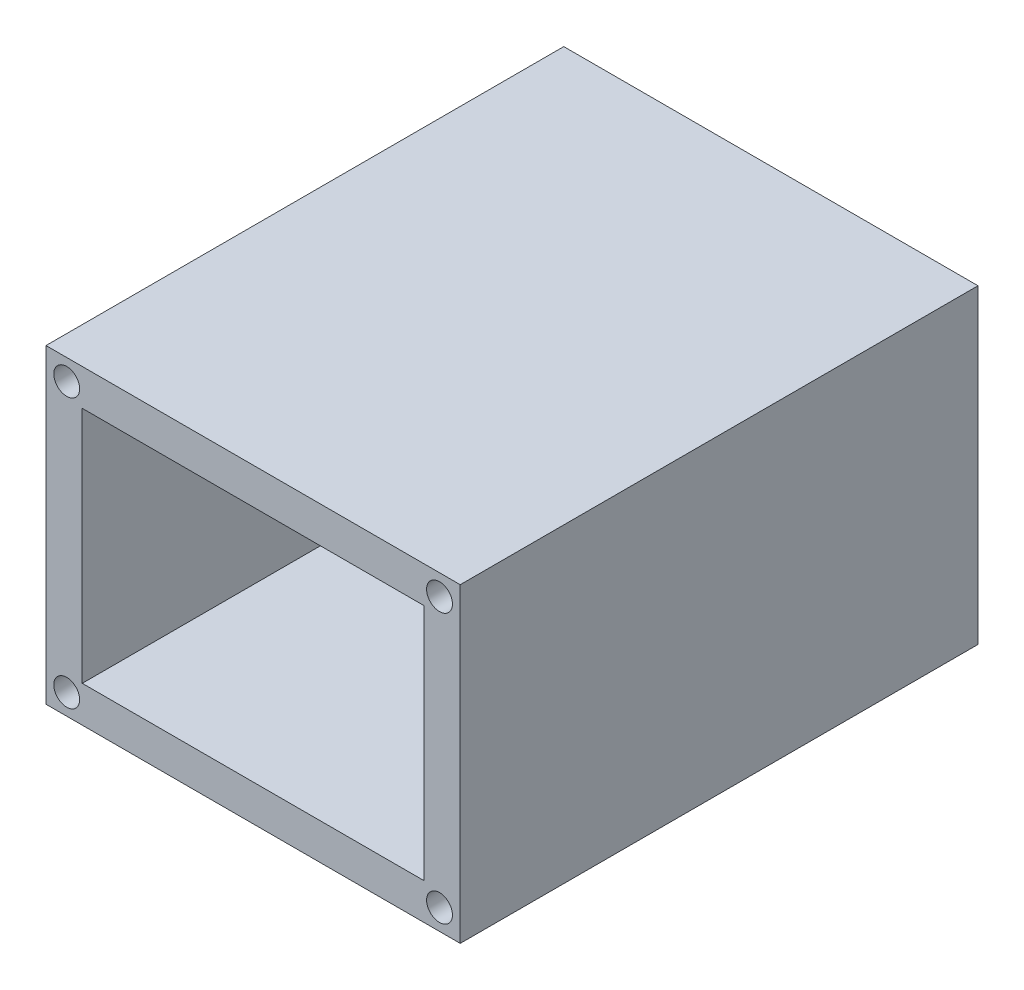
ISO-10303-21;
HEADER;
FILE_DESCRIPTION(('STEP AP214'),'2;1');
FILE_NAME('part.step','',(''),(''),'','','');
FILE_SCHEMA(('AUTOMOTIVE_DESIGN { 1 0 10303 214 1 1 1 1 }'));
ENDSEC;
DATA;
#1=APPLICATION_CONTEXT('core data for automotive mechanical design processes');
#2=APPLICATION_PROTOCOL_DEFINITION('international standard','automotive_design',2000,#1);
#3=PRODUCT_CONTEXT('',#1,'mechanical');
#4=PRODUCT('Part','Part','',(#3));
#5=PRODUCT_RELATED_PRODUCT_CATEGORY('part','',(#4));
#6=PRODUCT_DEFINITION_FORMATION('','',#4);
#7=PRODUCT_DEFINITION_CONTEXT('part definition',#1,'design');
#8=PRODUCT_DEFINITION('design','',#6,#7);
#9=PRODUCT_DEFINITION_SHAPE('','',#8);
#10=(LENGTH_UNIT() NAMED_UNIT(*) SI_UNIT(.MILLI.,.METRE.));
#11=(NAMED_UNIT(*) PLANE_ANGLE_UNIT() SI_UNIT($,.RADIAN.));
#12=(NAMED_UNIT(*) SI_UNIT($,.STERADIAN.) SOLID_ANGLE_UNIT());
#13=UNCERTAINTY_MEASURE_WITH_UNIT(LENGTH_MEASURE(1.E-05),#10,'distance_accuracy_value','');
#14=(GEOMETRIC_REPRESENTATION_CONTEXT(3) GLOBAL_UNCERTAINTY_ASSIGNED_CONTEXT((#13)) GLOBAL_UNIT_ASSIGNED_CONTEXT((#10,
#11,#12)) REPRESENTATION_CONTEXT('',''));
#15=CARTESIAN_POINT('',(0.,0.,0.));
#16=DIRECTION('',(0.,0.,1.));
#17=DIRECTION('',(1.,0.,0.));
#18=AXIS2_PLACEMENT_3D('',#15,#16,#17);
#19=CARTESIAN_POINT('',(0.,0.,50.));
#20=DIRECTION('',(1.,0.,0.));
#21=DIRECTION('',(0.,0.,-1.));
#22=AXIS2_PLACEMENT_3D('',#19,#20,#21);
#23=PLANE('',#22);
#24=DIRECTION('',(0.,-1.,0.));
#25=VECTOR('',#24,1.);
#26=CARTESIAN_POINT('',(0.,0.,0.));
#27=LINE('',#26,#25);
#28=CARTESIAN_POINT('',(0.,30.,0.));
#29=VERTEX_POINT('',#28);
#30=CARTESIAN_POINT('',(0.,0.,0.));
#31=VERTEX_POINT('',#30);
#32=EDGE_CURVE('E134',#29,#31,#27,.T.);
#33=ORIENTED_EDGE('',*,*,#32,.T.);
#34=DIRECTION('',(0.,0.,-1.));
#35=VECTOR('',#34,1.);
#36=CARTESIAN_POINT('',(0.,0.,50.));
#37=LINE('',#36,#35);
#38=CARTESIAN_POINT('',(0.,0.,50.));
#39=VERTEX_POINT('',#38);
#40=EDGE_CURVE('E11',#39,#31,#37,.T.);
#41=ORIENTED_EDGE('',*,*,#40,.F.);
#42=DIRECTION('',(0.,-1.,0.));
#43=VECTOR('',#42,1.);
#44=CARTESIAN_POINT('',(0.,0.,50.));
#45=LINE('',#44,#43);
#46=CARTESIAN_POINT('',(0.,30.,50.));
#47=VERTEX_POINT('',#46);
#48=EDGE_CURVE('E138',#47,#39,#45,.T.);
#49=ORIENTED_EDGE('',*,*,#48,.F.);
#50=DIRECTION('',(0.,0.,-1.));
#51=VECTOR('',#50,1.);
#52=CARTESIAN_POINT('',(0.,30.,50.));
#53=LINE('',#52,#51);
#54=EDGE_CURVE('E148',#47,#29,#53,.T.);
#55=ORIENTED_EDGE('',*,*,#54,.T.);
#56=EDGE_LOOP('',(#33,#41,#49,#55));
#57=FACE_BOUND('',#56,.T.);
#58=ADVANCED_FACE('F33',(#57),#23,.F.);
#59=CARTESIAN_POINT('',(0.,0.,50.));
#60=DIRECTION('',(0.,1.,0.));
#61=DIRECTION('',(0.,0.,1.));
#62=AXIS2_PLACEMENT_3D('',#59,#60,#61);
#63=PLANE('',#62);
#64=DIRECTION('',(1.,0.,0.));
#65=VECTOR('',#64,1.);
#66=CARTESIAN_POINT('',(0.,0.,0.));
#67=LINE('',#66,#65);
#68=CARTESIAN_POINT('',(40.,0.,0.));
#69=VERTEX_POINT('',#68);
#70=EDGE_CURVE('E151',#31,#69,#67,.T.);
#71=ORIENTED_EDGE('',*,*,#70,.T.);
#72=DIRECTION('',(0.,0.,-1.));
#73=VECTOR('',#72,1.);
#74=CARTESIAN_POINT('',(40.,0.,50.));
#75=LINE('',#74,#73);
#76=CARTESIAN_POINT('',(40.,0.,50.));
#77=VERTEX_POINT('',#76);
#78=EDGE_CURVE('E40',#77,#69,#75,.T.);
#79=ORIENTED_EDGE('',*,*,#78,.F.);
#80=DIRECTION('',(1.,0.,0.));
#81=VECTOR('',#80,1.);
#82=CARTESIAN_POINT('',(0.,0.,50.));
#83=LINE('',#82,#81);
#84=EDGE_CURVE('E141',#39,#77,#83,.T.);
#85=ORIENTED_EDGE('',*,*,#84,.F.);
#86=ORIENTED_EDGE('',*,*,#40,.T.);
#87=EDGE_LOOP('',(#71,#79,#85,#86));
#88=FACE_BOUND('',#87,.T.);
#89=ADVANCED_FACE('F179',(#88),#63,.F.);
#90=CARTESIAN_POINT('',(40.,0.,50.));
#91=DIRECTION('',(-1.,0.,0.));
#92=DIRECTION('',(0.,0.,1.));
#93=AXIS2_PLACEMENT_3D('',#90,#91,#92);
#94=PLANE('',#93);
#95=DIRECTION('',(0.,1.,0.));
#96=VECTOR('',#95,1.);
#97=CARTESIAN_POINT('',(40.,0.,0.));
#98=LINE('',#97,#96);
#99=CARTESIAN_POINT('',(40.,30.,0.));
#100=VERTEX_POINT('',#99);
#101=EDGE_CURVE('E153',#69,#100,#98,.T.);
#102=ORIENTED_EDGE('',*,*,#101,.T.);
#103=DIRECTION('',(0.,0.,-1.));
#104=VECTOR('',#103,1.);
#105=CARTESIAN_POINT('',(40.,30.,50.));
#106=LINE('',#105,#104);
#107=CARTESIAN_POINT('',(40.,30.,50.));
#108=VERTEX_POINT('',#107);
#109=EDGE_CURVE('E158',#108,#100,#106,.T.);
#110=ORIENTED_EDGE('',*,*,#109,.F.);
#111=DIRECTION('',(0.,1.,0.));
#112=VECTOR('',#111,1.);
#113=CARTESIAN_POINT('',(40.,0.,50.));
#114=LINE('',#113,#112);
#115=EDGE_CURVE('E144',#77,#108,#114,.T.);
#116=ORIENTED_EDGE('',*,*,#115,.F.);
#117=ORIENTED_EDGE('',*,*,#78,.T.);
#118=EDGE_LOOP('',(#102,#110,#116,#117));
#119=FACE_BOUND('',#118,.T.);
#120=ADVANCED_FACE('F165',(#119),#94,.F.);
#121=CARTESIAN_POINT('',(0.,30.,50.));
#122=DIRECTION('',(0.,-1.,0.));
#123=DIRECTION('',(0.,0.,-1.));
#124=AXIS2_PLACEMENT_3D('',#121,#122,#123);
#125=PLANE('',#124);
#126=DIRECTION('',(-1.,0.,0.));
#127=VECTOR('',#126,1.);
#128=CARTESIAN_POINT('',(0.,30.,0.));
#129=LINE('',#128,#127);
#130=EDGE_CURVE('E142',#100,#29,#129,.T.);
#131=ORIENTED_EDGE('',*,*,#130,.T.);
#132=ORIENTED_EDGE('',*,*,#54,.F.);
#133=DIRECTION('',(-1.,0.,0.));
#134=VECTOR('',#133,1.);
#135=CARTESIAN_POINT('',(0.,30.,50.));
#136=LINE('',#135,#134);
#137=EDGE_CURVE('E146',#108,#47,#136,.T.);
#138=ORIENTED_EDGE('',*,*,#137,.F.);
#139=ORIENTED_EDGE('',*,*,#109,.T.);
#140=EDGE_LOOP('',(#131,#132,#138,#139));
#141=FACE_BOUND('',#140,.T.);
#142=ADVANCED_FACE('F172',(#141),#125,.F.);
#143=CARTESIAN_POINT('',(0.,0.,50.));
#144=DIRECTION('',(0.,0.,-1.));
#145=DIRECTION('',(-1.,0.,0.));
#146=AXIS2_PLACEMENT_3D('',#143,#144,#145);
#147=PLANE('',#146);
#148=CARTESIAN_POINT('',(2.,28.,50.));
#149=DIRECTION('',(0.,0.,1.));
#150=DIRECTION('',(-1.,0.,0.));
#151=AXIS2_PLACEMENT_3D('',#148,#149,#150);
#152=CIRCLE('',#151,1.25);
#153=CARTESIAN_POINT('',(0.749999999999997,28.,50.));
#154=VERTEX_POINT('',#153);
#155=EDGE_CURVE('E241',#154,#154,#152,.T.);
#156=ORIENTED_EDGE('',*,*,#155,.F.);
#157=EDGE_LOOP('',(#156));
#158=FACE_BOUND('',#157,.T.);
#159=CARTESIAN_POINT('',(2.00000000000002,1.99999999999997,50.));
#160=DIRECTION('',(0.,0.,1.));
#161=DIRECTION('',(1.,0.,0.));
#162=AXIS2_PLACEMENT_3D('',#159,#160,#161);
#163=CIRCLE('',#162,1.25);
#164=CARTESIAN_POINT('',(3.25000000000002,1.99999999999997,50.));
#165=VERTEX_POINT('',#164);
#166=EDGE_CURVE('E250',#165,#165,#163,.T.);
#167=ORIENTED_EDGE('',*,*,#166,.F.);
#168=EDGE_LOOP('',(#167));
#169=FACE_BOUND('',#168,.T.);
#170=CARTESIAN_POINT('',(38.,2.,50.));
#171=DIRECTION('',(0.,0.,1.));
#172=DIRECTION('',(-1.,0.,0.));
#173=AXIS2_PLACEMENT_3D('',#170,#171,#172);
#174=CIRCLE('',#173,1.25);
#175=CARTESIAN_POINT('',(36.75,2.,50.));
#176=VERTEX_POINT('',#175);
#177=EDGE_CURVE('E256',#176,#176,#174,.T.);
#178=ORIENTED_EDGE('',*,*,#177,.F.);
#179=EDGE_LOOP('',(#178));
#180=FACE_BOUND('',#179,.T.);
#181=CARTESIAN_POINT('',(38.,28.,50.));
#182=DIRECTION('',(0.,0.,1.));
#183=DIRECTION('',(1.,0.,0.));
#184=AXIS2_PLACEMENT_3D('',#181,#182,#183);
#185=CIRCLE('',#184,1.25);
#186=CARTESIAN_POINT('',(39.25,28.,50.));
#187=VERTEX_POINT('',#186);
#188=EDGE_CURVE('E121',#187,#187,#185,.T.);
#189=ORIENTED_EDGE('',*,*,#188,.F.);
#190=EDGE_LOOP('',(#189));
#191=FACE_BOUND('',#190,.T.);
#192=DIRECTION('',(1.,0.,0.));
#193=VECTOR('',#192,1.);
#194=CARTESIAN_POINT('',(3.5,3.5,50.));
#195=LINE('',#194,#193);
#196=CARTESIAN_POINT('',(3.5,3.5,50.));
#197=VERTEX_POINT('',#196);
#198=CARTESIAN_POINT('',(36.5,3.5,50.));
#199=VERTEX_POINT('',#198);
#200=EDGE_CURVE('E127',#197,#199,#195,.T.);
#201=ORIENTED_EDGE('',*,*,#200,.F.);
#202=DIRECTION('',(0.,-1.,0.));
#203=VECTOR('',#202,1.);
#204=CARTESIAN_POINT('',(3.5,26.5,50.));
#205=LINE('',#204,#203);
#206=CARTESIAN_POINT('',(3.5,26.5,50.));
#207=VERTEX_POINT('',#206);
#208=EDGE_CURVE('E47',#207,#197,#205,.T.);
#209=ORIENTED_EDGE('',*,*,#208,.F.);
#210=DIRECTION('',(-1.,0.,0.));
#211=VECTOR('',#210,1.);
#212=CARTESIAN_POINT('',(3.5,26.5,50.));
#213=LINE('',#212,#211);
#214=CARTESIAN_POINT('',(36.5,26.5,50.));
#215=VERTEX_POINT('',#214);
#216=EDGE_CURVE('E115',#215,#207,#213,.T.);
#217=ORIENTED_EDGE('',*,*,#216,.F.);
#218=DIRECTION('',(0.,1.,0.));
#219=VECTOR('',#218,1.);
#220=CARTESIAN_POINT('',(36.5,26.5,50.));
#221=LINE('',#220,#219);
#222=EDGE_CURVE('E118',#199,#215,#221,.T.);
#223=ORIENTED_EDGE('',*,*,#222,.F.);
#224=EDGE_LOOP('',(#201,#209,#217,#223));
#225=FACE_BOUND('',#224,.T.);
#226=ORIENTED_EDGE('',*,*,#48,.T.);
#227=ORIENTED_EDGE('',*,*,#84,.T.);
#228=ORIENTED_EDGE('',*,*,#115,.T.);
#229=ORIENTED_EDGE('',*,*,#137,.T.);
#230=EDGE_LOOP('',(#226,#227,#228,#229));
#231=FACE_BOUND('',#230,.T.);
#232=ADVANCED_FACE('F178',(#158,#169,#180,#191,#225,#231),#147,.F.);
#233=CARTESIAN_POINT('',(0.,0.,0.));
#234=DIRECTION('',(0.,0.,-1.));
#235=DIRECTION('',(-1.,0.,0.));
#236=AXIS2_PLACEMENT_3D('',#233,#234,#235);
#237=PLANE('',#236);
#238=DIRECTION('',(0.,-1.,0.));
#239=VECTOR('',#238,1.);
#240=CARTESIAN_POINT('',(3.5,26.5,0.));
#241=LINE('',#240,#239);
#242=CARTESIAN_POINT('',(3.5,26.5,0.));
#243=VERTEX_POINT('',#242);
#244=CARTESIAN_POINT('',(3.5,3.5,0.));
#245=VERTEX_POINT('',#244);
#246=EDGE_CURVE('E99',#243,#245,#241,.T.);
#247=ORIENTED_EDGE('',*,*,#246,.T.);
#248=DIRECTION('',(1.,0.,0.));
#249=VECTOR('',#248,1.);
#250=CARTESIAN_POINT('',(3.5,3.5,0.));
#251=LINE('',#250,#249);
#252=CARTESIAN_POINT('',(36.5,3.5,0.));
#253=VERTEX_POINT('',#252);
#254=EDGE_CURVE('E108',#245,#253,#251,.T.);
#255=ORIENTED_EDGE('',*,*,#254,.T.);
#256=DIRECTION('',(0.,1.,0.));
#257=VECTOR('',#256,1.);
#258=CARTESIAN_POINT('',(36.5,26.5,0.));
#259=LINE('',#258,#257);
#260=CARTESIAN_POINT('',(36.5,26.5,0.));
#261=VERTEX_POINT('',#260);
#262=EDGE_CURVE('E55',#253,#261,#259,.T.);
#263=ORIENTED_EDGE('',*,*,#262,.T.);
#264=DIRECTION('',(-1.,0.,0.));
#265=VECTOR('',#264,1.);
#266=CARTESIAN_POINT('',(3.5,26.5,0.));
#267=LINE('',#266,#265);
#268=EDGE_CURVE('E105',#261,#243,#267,.T.);
#269=ORIENTED_EDGE('',*,*,#268,.T.);
#270=EDGE_LOOP('',(#247,#255,#263,#269));
#271=FACE_BOUND('',#270,.T.);
#272=ORIENTED_EDGE('',*,*,#32,.F.);
#273=ORIENTED_EDGE('',*,*,#130,.F.);
#274=ORIENTED_EDGE('',*,*,#101,.F.);
#275=ORIENTED_EDGE('',*,*,#70,.F.);
#276=EDGE_LOOP('',(#272,#273,#274,#275));
#277=FACE_BOUND('',#276,.T.);
#278=ADVANCED_FACE('F112',(#271,#277),#237,.T.);
#279=CARTESIAN_POINT('',(3.5,26.5,0.));
#280=DIRECTION('',(-1.,0.,0.));
#281=DIRECTION('',(0.,-1.,0.));
#282=AXIS2_PLACEMENT_3D('',#279,#280,#281);
#283=PLANE('',#282);
#284=ORIENTED_EDGE('',*,*,#208,.T.);
#285=DIRECTION('',(0.,0.,1.));
#286=VECTOR('',#285,1.);
#287=CARTESIAN_POINT('',(3.5,3.5,0.));
#288=LINE('',#287,#286);
#289=EDGE_CURVE('E95',#245,#197,#288,.T.);
#290=ORIENTED_EDGE('',*,*,#289,.F.);
#291=ORIENTED_EDGE('',*,*,#246,.F.);
#292=DIRECTION('',(0.,0.,1.));
#293=VECTOR('',#292,1.);
#294=CARTESIAN_POINT('',(3.5,26.5,0.));
#295=LINE('',#294,#293);
#296=EDGE_CURVE('E132',#243,#207,#295,.T.);
#297=ORIENTED_EDGE('',*,*,#296,.T.);
#298=EDGE_LOOP('',(#284,#290,#291,#297));
#299=FACE_BOUND('',#298,.T.);
#300=ADVANCED_FACE('F97',(#299),#283,.F.);
#301=CARTESIAN_POINT('',(3.5,26.5,0.));
#302=DIRECTION('',(0.,1.,0.));
#303=DIRECTION('',(-1.,0.,0.));
#304=AXIS2_PLACEMENT_3D('',#301,#302,#303);
#305=PLANE('',#304);
#306=ORIENTED_EDGE('',*,*,#216,.T.);
#307=ORIENTED_EDGE('',*,*,#296,.F.);
#308=ORIENTED_EDGE('',*,*,#268,.F.);
#309=DIRECTION('',(0.,0.,1.));
#310=VECTOR('',#309,1.);
#311=CARTESIAN_POINT('',(36.5,26.5,0.));
#312=LINE('',#311,#310);
#313=EDGE_CURVE('E135',#261,#215,#312,.T.);
#314=ORIENTED_EDGE('',*,*,#313,.T.);
#315=EDGE_LOOP('',(#306,#307,#308,#314));
#316=FACE_BOUND('',#315,.T.);
#317=ADVANCED_FACE('F196',(#316),#305,.F.);
#318=CARTESIAN_POINT('',(36.5,26.5,0.));
#319=DIRECTION('',(1.,0.,0.));
#320=DIRECTION('',(0.,1.,0.));
#321=AXIS2_PLACEMENT_3D('',#318,#319,#320);
#322=PLANE('',#321);
#323=ORIENTED_EDGE('',*,*,#222,.T.);
#324=ORIENTED_EDGE('',*,*,#313,.F.);
#325=ORIENTED_EDGE('',*,*,#262,.F.);
#326=DIRECTION('',(0.,0.,1.));
#327=VECTOR('',#326,1.);
#328=CARTESIAN_POINT('',(36.5,3.5,0.));
#329=LINE('',#328,#327);
#330=EDGE_CURVE('E104',#253,#199,#329,.T.);
#331=ORIENTED_EDGE('',*,*,#330,.T.);
#332=EDGE_LOOP('',(#323,#324,#325,#331));
#333=FACE_BOUND('',#332,.T.);
#334=ADVANCED_FACE('F200',(#333),#322,.F.);
#335=CARTESIAN_POINT('',(3.5,3.5,0.));
#336=DIRECTION('',(0.,-1.,0.));
#337=DIRECTION('',(1.,0.,0.));
#338=AXIS2_PLACEMENT_3D('',#335,#336,#337);
#339=PLANE('',#338);
#340=ORIENTED_EDGE('',*,*,#200,.T.);
#341=ORIENTED_EDGE('',*,*,#330,.F.);
#342=ORIENTED_EDGE('',*,*,#254,.F.);
#343=ORIENTED_EDGE('',*,*,#289,.T.);
#344=EDGE_LOOP('',(#340,#341,#342,#343));
#345=FACE_BOUND('',#344,.T.);
#346=ADVANCED_FACE('F109',(#345),#339,.F.);
#347=CARTESIAN_POINT('',(38.,28.,40.));
#348=DIRECTION('',(0.,0.,1.));
#349=DIRECTION('',(1.,0.,0.));
#350=AXIS2_PLACEMENT_3D('',#347,#348,#349);
#351=CYLINDRICAL_SURFACE('',#350,1.25);
#352=CARTESIAN_POINT('',(38.,28.,40.));
#353=DIRECTION('',(0.,0.,1.));
#354=DIRECTION('',(1.,0.,0.));
#355=AXIS2_PLACEMENT_3D('',#352,#353,#354);
#356=CIRCLE('',#355,1.25);
#357=CARTESIAN_POINT('',(39.25,28.,40.));
#358=VERTEX_POINT('',#357);
#359=EDGE_CURVE('E128',#358,#358,#356,.T.);
#360=ORIENTED_EDGE('',*,*,#359,.F.);
#361=EDGE_LOOP('',(#360));
#362=FACE_BOUND('',#361,.T.);
#363=ORIENTED_EDGE('',*,*,#188,.T.);
#364=EDGE_LOOP('',(#363));
#365=FACE_BOUND('',#364,.T.);
#366=ADVANCED_FACE('F199',(#362,#365),#351,.F.);
#367=CARTESIAN_POINT('',(38.,28.,40.));
#368=DIRECTION('',(0.,0.,1.));
#369=DIRECTION('',(1.,0.,0.));
#370=AXIS2_PLACEMENT_3D('',#367,#368,#369);
#371=PLANE('',#370);
#372=ORIENTED_EDGE('',*,*,#359,.T.);
#373=EDGE_LOOP('',(#372));
#374=FACE_BOUND('',#373,.T.);
#375=ADVANCED_FACE('F208',(#374),#371,.T.);
#376=CARTESIAN_POINT('',(38.,2.,40.));
#377=DIRECTION('',(0.,0.,1.));
#378=DIRECTION('',(1.,0.,0.));
#379=AXIS2_PLACEMENT_3D('',#376,#377,#378);
#380=CYLINDRICAL_SURFACE('',#379,1.25);
#381=CARTESIAN_POINT('',(38.,2.,40.));
#382=DIRECTION('',(0.,0.,1.));
#383=DIRECTION('',(-1.,0.,0.));
#384=AXIS2_PLACEMENT_3D('',#381,#382,#383);
#385=CIRCLE('',#384,1.25);
#386=CARTESIAN_POINT('',(36.75,2.,40.));
#387=VERTEX_POINT('',#386);
#388=EDGE_CURVE('E253',#387,#387,#385,.T.);
#389=ORIENTED_EDGE('',*,*,#388,.F.);
#390=EDGE_LOOP('',(#389));
#391=FACE_BOUND('',#390,.T.);
#392=ORIENTED_EDGE('',*,*,#177,.T.);
#393=EDGE_LOOP('',(#392));
#394=FACE_BOUND('',#393,.T.);
#395=ADVANCED_FACE('F212',(#391,#394),#380,.F.);
#396=CARTESIAN_POINT('',(38.,2.,40.));
#397=DIRECTION('',(0.,0.,-1.));
#398=DIRECTION('',(-1.,0.,0.));
#399=AXIS2_PLACEMENT_3D('',#396,#397,#398);
#400=PLANE('',#399);
#401=ORIENTED_EDGE('',*,*,#388,.T.);
#402=EDGE_LOOP('',(#401));
#403=FACE_BOUND('',#402,.T.);
#404=ADVANCED_FACE('F216',(#403),#400,.F.);
#405=CARTESIAN_POINT('',(2.00000000000002,1.99999999999997,40.));
#406=DIRECTION('',(0.,0.,1.));
#407=DIRECTION('',(1.,0.,0.));
#408=AXIS2_PLACEMENT_3D('',#405,#406,#407);
#409=CYLINDRICAL_SURFACE('',#408,1.25);
#410=CARTESIAN_POINT('',(2.00000000000002,1.99999999999997,40.));
#411=DIRECTION('',(0.,0.,1.));
#412=DIRECTION('',(1.,0.,0.));
#413=AXIS2_PLACEMENT_3D('',#410,#411,#412);
#414=CIRCLE('',#413,1.25);
#415=CARTESIAN_POINT('',(3.25000000000002,1.99999999999997,40.));
#416=VERTEX_POINT('',#415);
#417=EDGE_CURVE('E245',#416,#416,#414,.T.);
#418=ORIENTED_EDGE('',*,*,#417,.F.);
#419=EDGE_LOOP('',(#418));
#420=FACE_BOUND('',#419,.T.);
#421=ORIENTED_EDGE('',*,*,#166,.T.);
#422=EDGE_LOOP('',(#421));
#423=FACE_BOUND('',#422,.T.);
#424=ADVANCED_FACE('F220',(#420,#423),#409,.F.);
#425=CARTESIAN_POINT('',(2.00000000000002,1.99999999999997,40.));
#426=DIRECTION('',(0.,0.,1.));
#427=DIRECTION('',(1.,0.,0.));
#428=AXIS2_PLACEMENT_3D('',#425,#426,#427);
#429=PLANE('',#428);
#430=ORIENTED_EDGE('',*,*,#417,.T.);
#431=EDGE_LOOP('',(#430));
#432=FACE_BOUND('',#431,.T.);
#433=ADVANCED_FACE('F224',(#432),#429,.T.);
#434=CARTESIAN_POINT('',(2.,28.,40.));
#435=DIRECTION('',(0.,0.,1.));
#436=DIRECTION('',(1.,0.,0.));
#437=AXIS2_PLACEMENT_3D('',#434,#435,#436);
#438=CYLINDRICAL_SURFACE('',#437,1.25);
#439=CARTESIAN_POINT('',(2.,28.,40.));
#440=DIRECTION('',(0.,0.,1.));
#441=DIRECTION('',(-1.,0.,0.));
#442=AXIS2_PLACEMENT_3D('',#439,#440,#441);
#443=CIRCLE('',#442,1.25);
#444=CARTESIAN_POINT('',(0.749999999999997,28.,40.));
#445=VERTEX_POINT('',#444);
#446=EDGE_CURVE('E240',#445,#445,#443,.T.);
#447=ORIENTED_EDGE('',*,*,#446,.F.);
#448=EDGE_LOOP('',(#447));
#449=FACE_BOUND('',#448,.T.);
#450=ORIENTED_EDGE('',*,*,#155,.T.);
#451=EDGE_LOOP('',(#450));
#452=FACE_BOUND('',#451,.T.);
#453=ADVANCED_FACE('F228',(#449,#452),#438,.F.);
#454=CARTESIAN_POINT('',(2.,28.,40.));
#455=DIRECTION('',(0.,0.,-1.));
#456=DIRECTION('',(-1.,0.,0.));
#457=AXIS2_PLACEMENT_3D('',#454,#455,#456);
#458=PLANE('',#457);
#459=ORIENTED_EDGE('',*,*,#446,.T.);
#460=EDGE_LOOP('',(#459));
#461=FACE_BOUND('',#460,.T.);
#462=ADVANCED_FACE('F232',(#461),#458,.F.);
#463=CLOSED_SHELL('',(#58,#89,#120,#142,#232,#278,#300,#317,#334,#346,#366,#375,#395,#404,#424,
#433,#453,#462));
#464=MANIFOLD_SOLID_BREP('B2',#463);
#465=ADVANCED_BREP_SHAPE_REPRESENTATION('',(#18,#464),#14);
#466=SHAPE_DEFINITION_REPRESENTATION(#9,#465);
ENDSEC;
END-ISO-10303-21;
